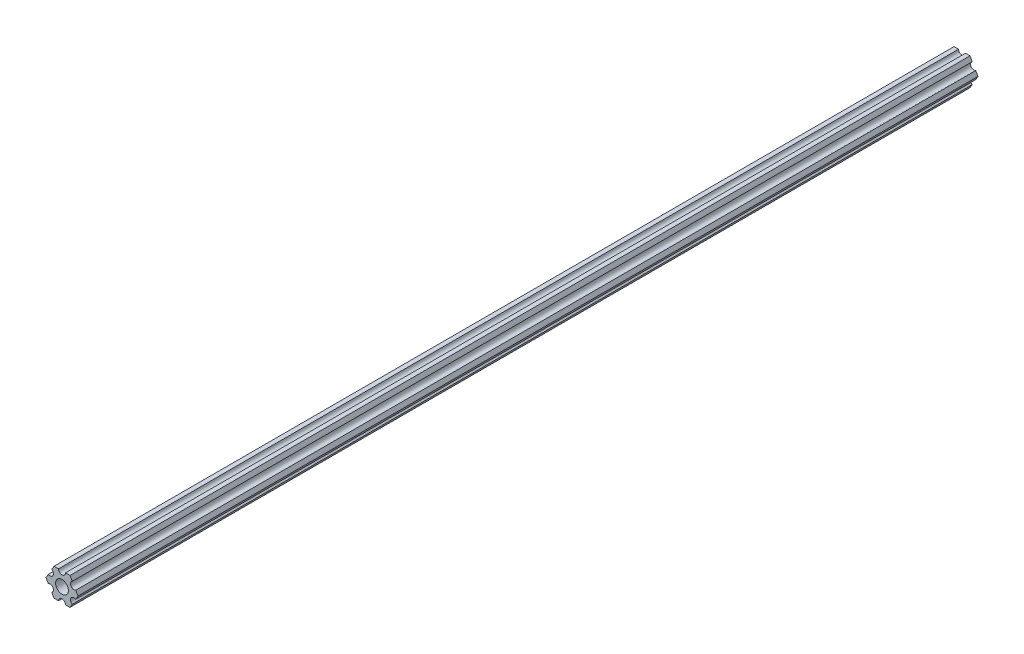
ISO-10303-21;
HEADER;
FILE_DESCRIPTION(('STEP AP214'),'2;1');
FILE_NAME('part.step','',(''),(''),'','','');
FILE_SCHEMA(('AUTOMOTIVE_DESIGN { 1 0 10303 214 1 1 1 1 }'));
ENDSEC;
DATA;
#1=APPLICATION_CONTEXT('core data for automotive mechanical design processes');
#2=APPLICATION_PROTOCOL_DEFINITION('international standard','automotive_design',2000,#1);
#3=PRODUCT_CONTEXT('',#1,'mechanical');
#4=PRODUCT('Part','Part','',(#3));
#5=PRODUCT_RELATED_PRODUCT_CATEGORY('part','',(#4));
#6=PRODUCT_DEFINITION_FORMATION('','',#4);
#7=PRODUCT_DEFINITION_CONTEXT('part definition',#1,'design');
#8=PRODUCT_DEFINITION('design','',#6,#7);
#9=PRODUCT_DEFINITION_SHAPE('','',#8);
#10=(LENGTH_UNIT() NAMED_UNIT(*) SI_UNIT(.MILLI.,.METRE.));
#11=(NAMED_UNIT(*) PLANE_ANGLE_UNIT() SI_UNIT($,.RADIAN.));
#12=(NAMED_UNIT(*) SI_UNIT($,.STERADIAN.) SOLID_ANGLE_UNIT());
#13=UNCERTAINTY_MEASURE_WITH_UNIT(LENGTH_MEASURE(1.E-05),#10,'distance_accuracy_value','');
#14=(GEOMETRIC_REPRESENTATION_CONTEXT(3) GLOBAL_UNCERTAINTY_ASSIGNED_CONTEXT((#13)) GLOBAL_UNIT_ASSIGNED_CONTEXT((#10,
#11,#12)) REPRESENTATION_CONTEXT('',''));
#15=CARTESIAN_POINT('',(0.,0.,0.));
#16=DIRECTION('',(0.,0.,1.));
#17=DIRECTION('',(1.,0.,0.));
#18=AXIS2_PLACEMENT_3D('',#15,#16,#17);
#19=CARTESIAN_POINT('',(6.29301142309098,-1.80018429024546,412.75));
#20=DIRECTION('',(-0.866025434075723,0.499999947533953,0.));
#21=DIRECTION('',(-0.499999947533953,-0.866025434075723,0.));
#22=AXIS2_PLACEMENT_3D('',#19,#20,#21);
#23=PLANE('',#22);
#24=DIRECTION('',(0.,0.,1.));
#25=VECTOR('',#24,1.);
#26=CARTESIAN_POINT('',(7.33234841870826,4.44212519169686E-07,412.75));
#27=LINE('',#26,#25);
#28=CARTESIAN_POINT('',(7.33234841870826,4.44212518961143E-07,0.));
#29=VERTEX_POINT('',#28);
#30=CARTESIAN_POINT('',(7.33234841870826,4.44212519315656E-07,412.75));
#31=VERTEX_POINT('',#30);
#32=EDGE_CURVE('E300',#29,#31,#27,.T.);
#33=ORIENTED_EDGE('',*,*,#32,.T.);
#34=DIRECTION('',(0.499999947533953,0.866025434075723,0.));
#35=VECTOR('',#34,1.);
#36=CARTESIAN_POINT('',(6.29301142309098,-1.80018429024546,412.75));
#37=LINE('',#36,#35);
#38=CARTESIAN_POINT('',(6.29301142309098,-1.80018429024546,412.75));
#39=VERTEX_POINT('',#38);
#40=EDGE_CURVE('E183',#39,#31,#37,.T.);
#41=ORIENTED_EDGE('',*,*,#40,.F.);
#42=DIRECTION('',(0.,0.,-1.));
#43=VECTOR('',#42,1.);
#44=CARTESIAN_POINT('',(6.29301142309098,-1.80018429024546,412.75));
#45=LINE('',#44,#43);
#46=CARTESIAN_POINT('',(6.29301142309098,-1.80018429024546,0.));
#47=VERTEX_POINT('',#46);
#48=EDGE_CURVE('E249',#39,#47,#45,.T.);
#49=ORIENTED_EDGE('',*,*,#48,.T.);
#50=DIRECTION('',(0.499999947533953,0.866025434075723,0.));
#51=VECTOR('',#50,1.);
#52=CARTESIAN_POINT('',(6.29301142309098,-1.80018429024546,0.));
#53=LINE('',#52,#51);
#54=EDGE_CURVE('E187',#47,#29,#53,.T.);
#55=ORIENTED_EDGE('',*,*,#54,.T.);
#56=EDGE_LOOP('',(#33,#41,#49,#55));
#57=FACE_BOUND('',#56,.T.);
#58=ADVANCED_FACE('F18',(#57),#23,.F.);
#59=CARTESIAN_POINT('',(7.33234841870826,4.44212519169686E-07,412.75));
#60=DIRECTION('',(-0.866025373493145,-0.500000052466056,0.));
#61=DIRECTION('',(0.500000052466056,-0.866025373493145,0.));
#62=AXIS2_PLACEMENT_3D('',#59,#60,#61);
#63=PLANE('',#62);
#64=DIRECTION('',(0.,0.,-1.));
#65=VECTOR('',#64,1.);
#66=CARTESIAN_POINT('',(6.29301120497139,1.80018505273895,412.75));
#67=LINE('',#66,#65);
#68=CARTESIAN_POINT('',(6.29301120497139,1.80018505273895,0.));
#69=VERTEX_POINT('',#68);
#70=CARTESIAN_POINT('',(6.29301120497139,1.80018505273895,412.75));
#71=VERTEX_POINT('',#70);
#72=EDGE_CURVE('E298',#69,#71,#67,.F.);
#73=ORIENTED_EDGE('',*,*,#72,.T.);
#74=DIRECTION('',(-0.500000052466056,0.866025373493145,0.));
#75=VECTOR('',#74,1.);
#76=CARTESIAN_POINT('',(7.33234841870826,4.44212519198905E-07,412.75));
#77=LINE('',#76,#75);
#78=EDGE_CURVE('E65',#31,#71,#77,.T.);
#79=ORIENTED_EDGE('',*,*,#78,.F.);
#80=ORIENTED_EDGE('',*,*,#32,.F.);
#81=DIRECTION('',(-0.500000052466056,0.866025373493145,0.));
#82=VECTOR('',#81,1.);
#83=CARTESIAN_POINT('',(7.33234841870826,4.44212519198905E-07,0.));
#84=LINE('',#83,#82);
#85=EDGE_CURVE('E246',#29,#69,#84,.T.);
#86=ORIENTED_EDGE('',*,*,#85,.T.);
#87=EDGE_LOOP('',(#73,#79,#80,#86));
#88=FACE_BOUND('',#87,.T.);
#89=ADVANCED_FACE('F347',(#88),#63,.F.);
#90=CARTESIAN_POINT('',(5.49926112168156,3.17500033315933,412.75));
#91=DIRECTION('',(0.,0.,-1.));
#92=DIRECTION('',(-1.,0.,0.));
#93=AXIS2_PLACEMENT_3D('',#90,#91,#92);
#94=CYLINDRICAL_SURFACE('',#93,1.5875);
#95=CARTESIAN_POINT('',(5.49926112168156,3.17500033315933,412.75));
#96=DIRECTION('',(0.,0.,-1.));
#97=DIRECTION('',(-1.,0.,0.));
#98=AXIS2_PLACEMENT_3D('',#95,#96,#97);
#99=CIRCLE('',#98,1.5875);
#100=CARTESIAN_POINT('',(4.70551103839172,4.54981561357972,412.75));
#101=VERTEX_POINT('',#100);
#102=EDGE_CURVE('E57',#71,#101,#99,.T.);
#103=ORIENTED_EDGE('',*,*,#102,.F.);
#104=ORIENTED_EDGE('',*,*,#72,.F.);
#105=CARTESIAN_POINT('',(5.49926112168156,3.17500033315933,0.));
#106=DIRECTION('',(0.,0.,-1.));
#107=DIRECTION('',(-1.,0.,0.));
#108=AXIS2_PLACEMENT_3D('',#105,#106,#107);
#109=CIRCLE('',#108,1.5875);
#110=CARTESIAN_POINT('',(4.70551103839172,4.54981561357972,0.));
#111=VERTEX_POINT('',#110);
#112=EDGE_CURVE('E21',#69,#111,#109,.T.);
#113=ORIENTED_EDGE('',*,*,#112,.T.);
#114=DIRECTION('',(0.,0.,1.));
#115=VECTOR('',#114,1.);
#116=CARTESIAN_POINT('',(4.70551103839172,4.54981561357972,412.75));
#117=LINE('',#116,#115);
#118=EDGE_CURVE('E294',#111,#101,#117,.T.);
#119=ORIENTED_EDGE('',*,*,#118,.T.);
#120=EDGE_LOOP('',(#103,#104,#113,#119));
#121=FACE_BOUND('',#120,.T.);
#122=ADVANCED_FACE('F345',(#121),#94,.F.);
#123=CARTESIAN_POINT('',(4.70551103839172,4.54981561357972,412.75));
#124=DIRECTION('',(-0.866025373493151,-0.500000052466046,0.));
#125=DIRECTION('',(0.500000052466046,-0.866025373493151,0.));
#126=AXIS2_PLACEMENT_3D('',#123,#124,#125);
#127=PLANE('',#126);
#128=DIRECTION('',(0.,0.,1.));
#129=VECTOR('',#128,1.);
#130=CARTESIAN_POINT('',(3.66617382465481,6.35000022210627,412.75));
#131=LINE('',#130,#129);
#132=CARTESIAN_POINT('',(3.66617382465481,6.35000022210627,-1.29526019539602E-13));
#133=VERTEX_POINT('',#132);
#134=CARTESIAN_POINT('',(3.66617382465481,6.35000022210627,412.75));
#135=VERTEX_POINT('',#134);
#136=EDGE_CURVE('E291',#133,#135,#131,.T.);
#137=ORIENTED_EDGE('',*,*,#136,.T.);
#138=DIRECTION('',(-0.500000052466046,0.866025373493151,0.));
#139=VECTOR('',#138,1.);
#140=CARTESIAN_POINT('',(4.70551103839172,4.54981561357972,412.75));
#141=LINE('',#140,#139);
#142=EDGE_CURVE('E176',#101,#135,#141,.T.);
#143=ORIENTED_EDGE('',*,*,#142,.F.);
#144=ORIENTED_EDGE('',*,*,#118,.F.);
#145=DIRECTION('',(-0.500000052466046,0.866025373493151,0.));
#146=VECTOR('',#145,1.);
#147=CARTESIAN_POINT('',(4.70551103839172,4.54981561357972,0.));
#148=LINE('',#147,#146);
#149=EDGE_CURVE('E239',#111,#133,#148,.T.);
#150=ORIENTED_EDGE('',*,*,#149,.T.);
#151=EDGE_LOOP('',(#137,#143,#144,#150));
#152=FACE_BOUND('',#151,.T.);
#153=ADVANCED_FACE('F338',(#152),#127,.F.);
#154=CARTESIAN_POINT('',(3.66617382465481,6.35000022210627,412.75));
#155=DIRECTION('',(6.05825850611185E-08,-0.999999999999998,0.));
#156=DIRECTION('',(0.999999999999998,6.05825850611185E-08,0.));
#157=AXIS2_PLACEMENT_3D('',#154,#155,#156);
#158=PLANE('',#157);
#159=DIRECTION('',(0.,0.,-1.));
#160=VECTOR('',#159,1.);
#161=CARTESIAN_POINT('',(1.58749961530074,6.35000009617482,412.75));
#162=LINE('',#161,#160);
#163=CARTESIAN_POINT('',(1.58749961530073,6.35000015914054,0.));
#164=VERTEX_POINT('',#163);
#165=CARTESIAN_POINT('',(1.58749961530073,6.35000015914054,412.75));
#166=VERTEX_POINT('',#165);
#167=EDGE_CURVE('E289',#164,#166,#162,.F.);
#168=ORIENTED_EDGE('',*,*,#167,.T.);
#169=DIRECTION('',(1.,0.,0.));
#170=VECTOR('',#169,1.);
#171=CARTESIAN_POINT('',(5.49926112168156,6.35000022210627,412.75));
#172=LINE('',#171,#170);
#173=EDGE_CURVE('E146',#135,#166,#172,.F.);
#174=ORIENTED_EDGE('',*,*,#173,.F.);
#175=ORIENTED_EDGE('',*,*,#136,.F.);
#176=DIRECTION('',(1.,0.,0.));
#177=VECTOR('',#176,1.);
#178=CARTESIAN_POINT('',(5.49926112168156,6.35000022210627,0.));
#179=LINE('',#178,#177);
#180=EDGE_CURVE('E236',#133,#164,#179,.F.);
#181=ORIENTED_EDGE('',*,*,#180,.T.);
#182=EDGE_LOOP('',(#168,#174,#175,#181));
#183=FACE_BOUND('',#182,.T.);
#184=ADVANCED_FACE('F335',(#183),#158,.F.);
#185=CARTESIAN_POINT('',(-3.84699260060323E-07,6.35,412.75));
#186=DIRECTION('',(0.,0.,-1.));
#187=DIRECTION('',(-1.,0.,0.));
#188=AXIS2_PLACEMENT_3D('',#185,#186,#187);
#189=CYLINDRICAL_SURFACE('',#188,1.5875);
#190=DIRECTION('',(0.,0.,1.));
#191=VECTOR('',#190,1.);
#192=CARTESIAN_POINT('',(-1.58750038469926,6.34999990382518,412.75));
#193=LINE('',#192,#191);
#194=CARTESIAN_POINT('',(-1.58750038469926,6.34999990382518,0.));
#195=VERTEX_POINT('',#194);
#196=CARTESIAN_POINT('',(-1.58750038469926,6.34999990382518,412.75));
#197=VERTEX_POINT('',#196);
#198=EDGE_CURVE('E105',#195,#197,#193,.T.);
#199=ORIENTED_EDGE('',*,*,#198,.T.);
#200=CARTESIAN_POINT('',(-3.84699260060323E-07,6.35,412.75));
#201=DIRECTION('',(0.,0.,-1.));
#202=DIRECTION('',(-1.,0.,0.));
#203=AXIS2_PLACEMENT_3D('',#200,#201,#202);
#204=CIRCLE('',#203,1.5875);
#205=EDGE_CURVE('E150',#166,#197,#204,.T.);
#206=ORIENTED_EDGE('',*,*,#205,.F.);
#207=ORIENTED_EDGE('',*,*,#167,.F.);
#208=CARTESIAN_POINT('',(-3.84699260060323E-07,6.35,0.));
#209=DIRECTION('',(0.,0.,-1.));
#210=DIRECTION('',(-1.,0.,0.));
#211=AXIS2_PLACEMENT_3D('',#208,#209,#210);
#212=CIRCLE('',#211,1.5875);
#213=EDGE_CURVE('E233',#164,#195,#212,.T.);
#214=ORIENTED_EDGE('',*,*,#213,.T.);
#215=EDGE_LOOP('',(#199,#206,#207,#214));
#216=FACE_BOUND('',#215,.T.);
#217=ADVANCED_FACE('F329',(#216),#189,.F.);
#218=CARTESIAN_POINT('',(-1.58750038469926,6.34999990382518,412.75));
#219=DIRECTION('',(6.05825963273174E-08,-0.999999999999998,0.));
#220=DIRECTION('',(0.999999999999998,6.05825963273174E-08,0.));
#221=AXIS2_PLACEMENT_3D('',#218,#219,#220);
#222=PLANE('',#221);
#223=DIRECTION('',(0.,0.,1.));
#224=VECTOR('',#223,1.);
#225=CARTESIAN_POINT('',(-3.66617459405349,6.3499997778937,412.75));
#226=LINE('',#225,#224);
#227=CARTESIAN_POINT('',(-3.66617454558244,6.34999986184803,-1.29526019539602E-13));
#228=VERTEX_POINT('',#227);
#229=CARTESIAN_POINT('',(-3.66617454558244,6.34999986184803,412.75));
#230=VERTEX_POINT('',#229);
#231=EDGE_CURVE('E113',#228,#230,#226,.T.);
#232=ORIENTED_EDGE('',*,*,#231,.T.);
#233=DIRECTION('',(1.,0.,0.));
#234=VECTOR('',#233,1.);
#235=CARTESIAN_POINT('',(5.49926112168156,6.34999990382518,412.75));
#236=LINE('',#235,#234);
#237=EDGE_CURVE('E151',#197,#230,#236,.F.);
#238=ORIENTED_EDGE('',*,*,#237,.F.);
#239=ORIENTED_EDGE('',*,*,#198,.F.);
#240=DIRECTION('',(1.,0.,0.));
#241=VECTOR('',#240,1.);
#242=CARTESIAN_POINT('',(5.49926112168156,6.34999990382518,0.));
#243=LINE('',#242,#241);
#244=EDGE_CURVE('E158',#195,#228,#243,.F.);
#245=ORIENTED_EDGE('',*,*,#244,.T.);
#246=EDGE_LOOP('',(#232,#238,#239,#245));
#247=FACE_BOUND('',#246,.T.);
#248=ADVANCED_FACE('F157',(#247),#222,.F.);
#249=CARTESIAN_POINT('',(-3.66617459405349,6.3499997778937,412.75));
#250=DIRECTION('',(0.866025434075729,-0.499999947533942,0.));
#251=DIRECTION('',(0.499999947533942,0.866025434075729,0.));
#252=AXIS2_PLACEMENT_3D('',#249,#250,#251);
#253=PLANE('',#252);
#254=DIRECTION('',(0.,0.,-1.));
#255=VECTOR('',#254,1.);
#256=CARTESIAN_POINT('',(-4.70551158967065,4.54981504343587,412.75));
#257=LINE('',#256,#255);
#258=CARTESIAN_POINT('',(-4.70551158967065,4.54981504343587,0.));
#259=VERTEX_POINT('',#258);
#260=CARTESIAN_POINT('',(-4.70551158967065,4.54981504343587,412.75));
#261=VERTEX_POINT('',#260);
#262=EDGE_CURVE('E159',#259,#261,#257,.F.);
#263=ORIENTED_EDGE('',*,*,#262,.T.);
#264=DIRECTION('',(-0.499999947533943,-0.866025434075729,0.));
#265=VECTOR('',#264,1.);
#266=CARTESIAN_POINT('',(-3.66617459405349,6.3499997778937,412.75));
#267=LINE('',#266,#265);
#268=EDGE_CURVE('E154',#230,#261,#267,.T.);
#269=ORIENTED_EDGE('',*,*,#268,.F.);
#270=ORIENTED_EDGE('',*,*,#231,.F.);
#271=DIRECTION('',(-0.499999947533943,-0.866025434075729,0.));
#272=VECTOR('',#271,1.);
#273=CARTESIAN_POINT('',(-3.66617459405349,6.3499997778937,0.));
#274=LINE('',#273,#272);
#275=EDGE_CURVE('E228',#228,#259,#274,.T.);
#276=ORIENTED_EDGE('',*,*,#275,.T.);
#277=EDGE_LOOP('',(#263,#269,#270,#276));
#278=FACE_BOUND('',#277,.T.);
#279=ADVANCED_FACE('F161',(#278),#253,.F.);
#280=CARTESIAN_POINT('',(-5.49926150638082,3.17499966684067,412.75));
#281=DIRECTION('',(0.,0.,-1.));
#282=DIRECTION('',(-1.,0.,0.));
#283=AXIS2_PLACEMENT_3D('',#280,#281,#282);
#284=CYLINDRICAL_SURFACE('',#283,1.5875);
#285=DIRECTION('',(0.,0.,1.));
#286=VECTOR('',#285,1.);
#287=CARTESIAN_POINT('',(-6.29301142309098,1.80018429024547,412.75));
#288=LINE('',#287,#286);
#289=CARTESIAN_POINT('',(-6.29301142309098,1.80018429024547,0.));
#290=VERTEX_POINT('',#289);
#291=CARTESIAN_POINT('',(-6.29301142309098,1.80018429024547,412.75));
#292=VERTEX_POINT('',#291);
#293=EDGE_CURVE('E280',#290,#292,#288,.T.);
#294=ORIENTED_EDGE('',*,*,#293,.T.);
#295=CARTESIAN_POINT('',(-5.49926150638082,3.17499966684067,412.75));
#296=DIRECTION('',(0.,0.,-1.));
#297=DIRECTION('',(-1.,0.,0.));
#298=AXIS2_PLACEMENT_3D('',#295,#296,#297);
#299=CIRCLE('',#298,1.5875);
#300=EDGE_CURVE('E163',#261,#292,#299,.T.);
#301=ORIENTED_EDGE('',*,*,#300,.F.);
#302=ORIENTED_EDGE('',*,*,#262,.F.);
#303=CARTESIAN_POINT('',(-5.49926150638082,3.17499966684067,0.));
#304=DIRECTION('',(0.,0.,-1.));
#305=DIRECTION('',(-1.,0.,0.));
#306=AXIS2_PLACEMENT_3D('',#303,#304,#305);
#307=CIRCLE('',#306,1.5875);
#308=EDGE_CURVE('E225',#259,#290,#307,.T.);
#309=ORIENTED_EDGE('',*,*,#308,.T.);
#310=EDGE_LOOP('',(#294,#301,#302,#309));
#311=FACE_BOUND('',#310,.T.);
#312=ADVANCED_FACE('F410',(#311),#284,.F.);
#313=CARTESIAN_POINT('',(-6.29301142309098,1.80018429024547,412.75));
#314=DIRECTION('',(0.866025434075724,-0.499999947533951,0.));
#315=DIRECTION('',(0.499999947533951,0.866025434075724,0.));
#316=AXIS2_PLACEMENT_3D('',#313,#314,#315);
#317=PLANE('',#316);
#318=DIRECTION('',(0.,0.,1.));
#319=VECTOR('',#318,1.);
#320=CARTESIAN_POINT('',(-7.33234841870826,-4.44212523790841E-07,412.75));
#321=LINE('',#320,#319);
#322=CARTESIAN_POINT('',(-7.33234841870826,-4.44212524036367E-07,0.));
#323=VERTEX_POINT('',#322);
#324=CARTESIAN_POINT('',(-7.33234841870826,-4.44212524036367E-07,412.75));
#325=VERTEX_POINT('',#324);
#326=EDGE_CURVE('E277',#323,#325,#321,.T.);
#327=ORIENTED_EDGE('',*,*,#326,.T.);
#328=DIRECTION('',(-0.499999947533952,-0.866025434075724,0.));
#329=VECTOR('',#328,1.);
#330=CARTESIAN_POINT('',(-6.29301142309098,1.80018429024547,412.75));
#331=LINE('',#330,#329);
#332=EDGE_CURVE('E165',#292,#325,#331,.T.);
#333=ORIENTED_EDGE('',*,*,#332,.F.);
#334=ORIENTED_EDGE('',*,*,#293,.F.);
#335=DIRECTION('',(-0.499999947533952,-0.866025434075724,0.));
#336=VECTOR('',#335,1.);
#337=CARTESIAN_POINT('',(-6.29301142309098,1.80018429024547,0.));
#338=LINE('',#337,#336);
#339=EDGE_CURVE('E220',#290,#323,#338,.T.);
#340=ORIENTED_EDGE('',*,*,#339,.T.);
#341=EDGE_LOOP('',(#327,#333,#334,#340));
#342=FACE_BOUND('',#341,.T.);
#343=ADVANCED_FACE('F378',(#342),#317,.F.);
#344=CARTESIAN_POINT('',(-7.33234841870826,-4.44212523790841E-07,412.75));
#345=DIRECTION('',(0.866025373493151,0.500000052466045,0.));
#346=DIRECTION('',(-0.500000052466045,0.866025373493151,0.));
#347=AXIS2_PLACEMENT_3D('',#344,#345,#346);
#348=PLANE('',#347);
#349=DIRECTION('',(0.,0.,-1.));
#350=VECTOR('',#349,1.);
#351=CARTESIAN_POINT('',(-6.29301120497141,-1.80018505273896,412.75));
#352=LINE('',#351,#350);
#353=CARTESIAN_POINT('',(-6.29301120497141,-1.80018505273896,0.));
#354=VERTEX_POINT('',#353);
#355=CARTESIAN_POINT('',(-6.29301120497141,-1.80018505273896,412.75));
#356=VERTEX_POINT('',#355);
#357=EDGE_CURVE('E274',#354,#356,#352,.F.);
#358=ORIENTED_EDGE('',*,*,#357,.T.);
#359=DIRECTION('',(0.500000052466045,-0.866025373493151,0.));
#360=VECTOR('',#359,1.);
#361=CARTESIAN_POINT('',(-7.33234841870826,-4.44212523969395E-07,412.75));
#362=LINE('',#361,#360);
#363=EDGE_CURVE('E315',#325,#356,#362,.T.);
#364=ORIENTED_EDGE('',*,*,#363,.F.);
#365=ORIENTED_EDGE('',*,*,#326,.F.);
#366=DIRECTION('',(0.500000052466045,-0.866025373493151,0.));
#367=VECTOR('',#366,1.);
#368=CARTESIAN_POINT('',(-7.33234841870826,-4.44212523969395E-07,0.));
#369=LINE('',#368,#367);
#370=EDGE_CURVE('E217',#323,#354,#369,.T.);
#371=ORIENTED_EDGE('',*,*,#370,.T.);
#372=EDGE_LOOP('',(#358,#364,#365,#371));
#373=FACE_BOUND('',#372,.T.);
#374=ADVANCED_FACE('F382',(#373),#348,.F.);
#375=CARTESIAN_POINT('',(-5.49926112168156,-3.17500033315934,412.75));
#376=DIRECTION('',(0.,0.,-1.));
#377=DIRECTION('',(-1.,0.,0.));
#378=AXIS2_PLACEMENT_3D('',#375,#376,#377);
#379=CYLINDRICAL_SURFACE('',#378,1.5875);
#380=DIRECTION('',(0.,0.,1.));
#381=VECTOR('',#380,1.);
#382=CARTESIAN_POINT('',(-4.70551103839172,-4.54981561357972,412.75));
#383=LINE('',#382,#381);
#384=CARTESIAN_POINT('',(-4.70551103839172,-4.54981561357972,0.));
#385=VERTEX_POINT('',#384);
#386=CARTESIAN_POINT('',(-4.70551103839172,-4.54981561357972,412.75));
#387=VERTEX_POINT('',#386);
#388=EDGE_CURVE('E269',#385,#387,#383,.T.);
#389=ORIENTED_EDGE('',*,*,#388,.T.);
#390=CARTESIAN_POINT('',(-5.49926112168156,-3.17500033315934,412.75));
#391=DIRECTION('',(0.,0.,-1.));
#392=DIRECTION('',(-1.,0.,0.));
#393=AXIS2_PLACEMENT_3D('',#390,#391,#392);
#394=CIRCLE('',#393,1.5875);
#395=EDGE_CURVE('E313',#356,#387,#394,.T.);
#396=ORIENTED_EDGE('',*,*,#395,.F.);
#397=ORIENTED_EDGE('',*,*,#357,.F.);
#398=CARTESIAN_POINT('',(-5.49926112168156,-3.17500033315934,0.));
#399=DIRECTION('',(0.,0.,-1.));
#400=DIRECTION('',(-1.,0.,0.));
#401=AXIS2_PLACEMENT_3D('',#398,#399,#400);
#402=CIRCLE('',#401,1.5875);
#403=EDGE_CURVE('E214',#354,#385,#402,.T.);
#404=ORIENTED_EDGE('',*,*,#403,.T.);
#405=EDGE_LOOP('',(#389,#396,#397,#404));
#406=FACE_BOUND('',#405,.T.);
#407=ADVANCED_FACE('F386',(#406),#379,.F.);
#408=CARTESIAN_POINT('',(-4.70551103839172,-4.54981561357972,412.75));
#409=DIRECTION('',(0.866025373493151,0.500000052466045,0.));
#410=DIRECTION('',(-0.500000052466045,0.866025373493151,0.));
#411=AXIS2_PLACEMENT_3D('',#408,#409,#410);
#412=PLANE('',#411);
#413=DIRECTION('',(0.,0.,1.));
#414=VECTOR('',#413,1.);
#415=CARTESIAN_POINT('',(-3.66617382465481,-6.35000022210628,412.75));
#416=LINE('',#415,#414);
#417=CARTESIAN_POINT('',(-3.6661738246548,-6.35000022210628,-1.29526019539602E-13));
#418=VERTEX_POINT('',#417);
#419=CARTESIAN_POINT('',(-3.6661738246548,-6.35000022210628,412.75));
#420=VERTEX_POINT('',#419);
#421=EDGE_CURVE('E266',#418,#420,#416,.T.);
#422=ORIENTED_EDGE('',*,*,#421,.T.);
#423=DIRECTION('',(0.500000052466045,-0.866025373493151,0.));
#424=VECTOR('',#423,1.);
#425=CARTESIAN_POINT('',(-4.70551103839172,-4.54981561357972,412.75));
#426=LINE('',#425,#424);
#427=EDGE_CURVE('E314',#387,#420,#426,.T.);
#428=ORIENTED_EDGE('',*,*,#427,.F.);
#429=ORIENTED_EDGE('',*,*,#388,.F.);
#430=DIRECTION('',(0.500000052466045,-0.866025373493151,0.));
#431=VECTOR('',#430,1.);
#432=CARTESIAN_POINT('',(-4.70551103839172,-4.54981561357972,0.));
#433=LINE('',#432,#431);
#434=EDGE_CURVE('E209',#385,#418,#433,.T.);
#435=ORIENTED_EDGE('',*,*,#434,.T.);
#436=EDGE_LOOP('',(#422,#428,#429,#435));
#437=FACE_BOUND('',#436,.T.);
#438=ADVANCED_FACE('F392',(#437),#412,.F.);
#439=CARTESIAN_POINT('',(-3.66617382465481,-6.35000022210628,412.75));
#440=DIRECTION('',(-6.05825854783851E-08,0.999999999999998,0.));
#441=DIRECTION('',(-0.999999999999998,-6.05825854783851E-08,0.));
#442=AXIS2_PLACEMENT_3D('',#439,#440,#441);
#443=PLANE('',#442);
#444=DIRECTION('',(0.,0.,-1.));
#445=VECTOR('',#444,1.);
#446=CARTESIAN_POINT('',(-1.58749961530074,-6.35,412.75));
#447=LINE('',#446,#445);
#448=CARTESIAN_POINT('',(-1.58749961530073,-6.35000011105314,0.));
#449=VERTEX_POINT('',#448);
#450=CARTESIAN_POINT('',(-1.58749961530073,-6.35000011105314,412.75));
#451=VERTEX_POINT('',#450);
#452=EDGE_CURVE('E263',#449,#451,#447,.F.);
#453=ORIENTED_EDGE('',*,*,#452,.T.);
#454=DIRECTION('',(1.,0.,0.));
#455=VECTOR('',#454,1.);
#456=CARTESIAN_POINT('',(5.49926112168156,-6.35000022210628,412.75));
#457=LINE('',#456,#455);
#458=EDGE_CURVE('E312',#420,#451,#457,.T.);
#459=ORIENTED_EDGE('',*,*,#458,.F.);
#460=ORIENTED_EDGE('',*,*,#421,.F.);
#461=DIRECTION('',(1.,0.,0.));
#462=VECTOR('',#461,1.);
#463=CARTESIAN_POINT('',(5.49926112168156,-6.35000022210628,0.));
#464=LINE('',#463,#462);
#465=EDGE_CURVE('E206',#418,#449,#464,.T.);
#466=ORIENTED_EDGE('',*,*,#465,.T.);
#467=EDGE_LOOP('',(#453,#459,#460,#466));
#468=FACE_BOUND('',#467,.T.);
#469=ADVANCED_FACE('F396',(#468),#443,.F.);
#470=CARTESIAN_POINT('',(3.8469926204343E-07,-6.35,412.75));
#471=DIRECTION('',(0.,0.,-1.));
#472=DIRECTION('',(-1.,0.,0.));
#473=AXIS2_PLACEMENT_3D('',#470,#471,#472);
#474=CYLINDRICAL_SURFACE('',#473,1.5875);
#475=DIRECTION('',(0.,0.,1.));
#476=VECTOR('',#475,1.);
#477=CARTESIAN_POINT('',(1.58750038469926,-6.34999990382518,412.75));
#478=LINE('',#477,#476);
#479=CARTESIAN_POINT('',(1.58750038469926,-6.34999990382518,0.));
#480=VERTEX_POINT('',#479);
#481=CARTESIAN_POINT('',(1.58750038469926,-6.34999990382518,412.75));
#482=VERTEX_POINT('',#481);
#483=EDGE_CURVE('E258',#480,#482,#478,.T.);
#484=ORIENTED_EDGE('',*,*,#483,.T.);
#485=CARTESIAN_POINT('',(3.8469926204343E-07,-6.35,412.75));
#486=DIRECTION('',(0.,0.,-1.));
#487=DIRECTION('',(-1.,0.,0.));
#488=AXIS2_PLACEMENT_3D('',#485,#486,#487);
#489=CIRCLE('',#488,1.5875);
#490=EDGE_CURVE('E309',#451,#482,#489,.T.);
#491=ORIENTED_EDGE('',*,*,#490,.F.);
#492=ORIENTED_EDGE('',*,*,#452,.F.);
#493=CARTESIAN_POINT('',(3.8469926204343E-07,-6.35,0.));
#494=DIRECTION('',(0.,0.,-1.));
#495=DIRECTION('',(-1.,0.,0.));
#496=AXIS2_PLACEMENT_3D('',#493,#494,#495);
#497=CIRCLE('',#496,1.5875);
#498=EDGE_CURVE('E203',#449,#480,#497,.T.);
#499=ORIENTED_EDGE('',*,*,#498,.T.);
#500=EDGE_LOOP('',(#484,#491,#492,#499));
#501=FACE_BOUND('',#500,.T.);
#502=ADVANCED_FACE('F400',(#501),#474,.F.);
#503=CARTESIAN_POINT('',(1.58750038469926,-6.34999990382518,412.75));
#504=DIRECTION('',(-6.05825721258438E-08,0.999999999999998,0.));
#505=DIRECTION('',(-0.999999999999998,-6.05825721258438E-08,0.));
#506=AXIS2_PLACEMENT_3D('',#503,#504,#505);
#507=PLANE('',#506);
#508=DIRECTION('',(0.,0.,1.));
#509=VECTOR('',#508,1.);
#510=CARTESIAN_POINT('',(3.66617459405346,-6.34999977789375,412.75));
#511=LINE('',#510,#509);
#512=CARTESIAN_POINT('',(3.66617454558244,-6.34999986184804,-1.29526019539602E-13));
#513=VERTEX_POINT('',#512);
#514=CARTESIAN_POINT('',(3.66617454558244,-6.34999986184804,412.75));
#515=VERTEX_POINT('',#514);
#516=EDGE_CURVE('E255',#513,#515,#511,.T.);
#517=ORIENTED_EDGE('',*,*,#516,.T.);
#518=DIRECTION('',(1.,0.,0.));
#519=VECTOR('',#518,1.);
#520=CARTESIAN_POINT('',(5.49926112168156,-6.34999990382518,412.75));
#521=LINE('',#520,#519);
#522=EDGE_CURVE('E311',#482,#515,#521,.T.);
#523=ORIENTED_EDGE('',*,*,#522,.F.);
#524=ORIENTED_EDGE('',*,*,#483,.F.);
#525=DIRECTION('',(1.,0.,0.));
#526=VECTOR('',#525,1.);
#527=CARTESIAN_POINT('',(5.49926112168156,-6.34999990382518,0.));
#528=LINE('',#527,#526);
#529=EDGE_CURVE('E198',#480,#513,#528,.T.);
#530=ORIENTED_EDGE('',*,*,#529,.T.);
#531=EDGE_LOOP('',(#517,#523,#524,#530));
#532=FACE_BOUND('',#531,.T.);
#533=ADVANCED_FACE('F403',(#532),#507,.F.);
#534=CARTESIAN_POINT('',(3.66617459405346,-6.34999977789375,412.75));
#535=DIRECTION('',(-0.86602543407573,0.499999947533941,0.));
#536=DIRECTION('',(-0.499999947533941,-0.86602543407573,0.));
#537=AXIS2_PLACEMENT_3D('',#534,#535,#536);
#538=PLANE('',#537);
#539=DIRECTION('',(0.,0.,1.));
#540=VECTOR('',#539,1.);
#541=CARTESIAN_POINT('',(4.70551158967065,-4.54981504343587,412.75));
#542=LINE('',#541,#540);
#543=CARTESIAN_POINT('',(4.70551158967065,-4.54981504343587,412.75));
#544=VERTEX_POINT('',#543);
#545=CARTESIAN_POINT('',(4.70551158967065,-4.54981504343587,0.));
#546=VERTEX_POINT('',#545);
#547=EDGE_CURVE('E253',#544,#546,#542,.F.);
#548=ORIENTED_EDGE('',*,*,#547,.F.);
#549=DIRECTION('',(0.49999994753394,0.86602543407573,0.));
#550=VECTOR('',#549,1.);
#551=CARTESIAN_POINT('',(3.66617459405346,-6.34999977789376,412.75));
#552=LINE('',#551,#550);
#553=EDGE_CURVE('E308',#515,#544,#552,.T.);
#554=ORIENTED_EDGE('',*,*,#553,.F.);
#555=ORIENTED_EDGE('',*,*,#516,.F.);
#556=DIRECTION('',(0.49999994753394,0.86602543407573,0.));
#557=VECTOR('',#556,1.);
#558=CARTESIAN_POINT('',(3.66617459405346,-6.34999977789376,0.));
#559=LINE('',#558,#557);
#560=EDGE_CURVE('E195',#513,#546,#559,.T.);
#561=ORIENTED_EDGE('',*,*,#560,.T.);
#562=EDGE_LOOP('',(#548,#554,#555,#561));
#563=FACE_BOUND('',#562,.T.);
#564=ADVANCED_FACE('F405',(#563),#538,.F.);
#565=CARTESIAN_POINT('',(5.49926150638082,-3.17499966684067,412.75));
#566=DIRECTION('',(0.,0.,-1.));
#567=DIRECTION('',(-1.,0.,0.));
#568=AXIS2_PLACEMENT_3D('',#565,#566,#567);
#569=CYLINDRICAL_SURFACE('',#568,1.58750000000001);
#570=CARTESIAN_POINT('',(5.49926150638082,-3.17499966684067,412.75));
#571=DIRECTION('',(0.,0.,-1.));
#572=DIRECTION('',(-1.,0.,0.));
#573=AXIS2_PLACEMENT_3D('',#570,#571,#572);
#574=CIRCLE('',#573,1.58750000000001);
#575=EDGE_CURVE('E36',#544,#39,#574,.T.);
#576=ORIENTED_EDGE('',*,*,#575,.F.);
#577=ORIENTED_EDGE('',*,*,#547,.T.);
#578=CARTESIAN_POINT('',(5.49926150638082,-3.17499966684067,0.));
#579=DIRECTION('',(0.,0.,-1.));
#580=DIRECTION('',(-1.,0.,0.));
#581=AXIS2_PLACEMENT_3D('',#578,#579,#580);
#582=CIRCLE('',#581,1.58750000000001);
#583=EDGE_CURVE('E192',#546,#47,#582,.T.);
#584=ORIENTED_EDGE('',*,*,#583,.T.);
#585=ORIENTED_EDGE('',*,*,#48,.F.);
#586=EDGE_LOOP('',(#576,#577,#584,#585));
#587=FACE_BOUND('',#586,.T.);
#588=ADVANCED_FACE('F351',(#587),#569,.F.);
#589=CARTESIAN_POINT('',(5.49926112168156,3.17500033315933,0.));
#590=DIRECTION('',(0.,0.,1.));
#591=DIRECTION('',(1.,0.,0.));
#592=AXIS2_PLACEMENT_3D('',#589,#590,#591);
#593=PLANE('',#592);
#594=CARTESIAN_POINT('',(0.,0.,0.));
#595=DIRECTION('',(0.,0.,-1.));
#596=DIRECTION('',(-1.,0.,0.));
#597=AXIS2_PLACEMENT_3D('',#594,#595,#596);
#598=CIRCLE('',#597,2.9337);
#599=CARTESIAN_POINT('',(-2.9337,0.,0.));
#600=VERTEX_POINT('',#599);
#601=EDGE_CURVE('E27',#600,#600,#598,.F.);
#602=ORIENTED_EDGE('',*,*,#601,.T.);
#603=EDGE_LOOP('',(#602));
#604=FACE_BOUND('',#603,.T.);
#605=ORIENTED_EDGE('',*,*,#583,.F.);
#606=ORIENTED_EDGE('',*,*,#560,.F.);
#607=ORIENTED_EDGE('',*,*,#529,.F.);
#608=ORIENTED_EDGE('',*,*,#498,.F.);
#609=ORIENTED_EDGE('',*,*,#465,.F.);
#610=ORIENTED_EDGE('',*,*,#434,.F.);
#611=ORIENTED_EDGE('',*,*,#403,.F.);
#612=ORIENTED_EDGE('',*,*,#370,.F.);
#613=ORIENTED_EDGE('',*,*,#339,.F.);
#614=ORIENTED_EDGE('',*,*,#308,.F.);
#615=ORIENTED_EDGE('',*,*,#275,.F.);
#616=ORIENTED_EDGE('',*,*,#244,.F.);
#617=ORIENTED_EDGE('',*,*,#213,.F.);
#618=ORIENTED_EDGE('',*,*,#180,.F.);
#619=ORIENTED_EDGE('',*,*,#149,.F.);
#620=ORIENTED_EDGE('',*,*,#112,.F.);
#621=ORIENTED_EDGE('',*,*,#85,.F.);
#622=ORIENTED_EDGE('',*,*,#54,.F.);
#623=EDGE_LOOP('',(#605,#606,#607,#608,#609,#610,#611,#612,#613,#614,#615,#616,#617,#618,#619,
#620,#621,#622));
#624=FACE_BOUND('',#623,.T.);
#625=ADVANCED_FACE('F332',(#604,#624),#593,.F.);
#626=CARTESIAN_POINT('',(5.49926112168156,3.17500033315933,412.75));
#627=DIRECTION('',(0.,0.,1.));
#628=DIRECTION('',(1.,0.,0.));
#629=AXIS2_PLACEMENT_3D('',#626,#627,#628);
#630=PLANE('',#629);
#631=CARTESIAN_POINT('',(0.,0.,412.75));
#632=DIRECTION('',(0.,0.,-1.));
#633=DIRECTION('',(-1.,0.,0.));
#634=AXIS2_PLACEMENT_3D('',#631,#632,#633);
#635=CIRCLE('',#634,2.9337);
#636=CARTESIAN_POINT('',(-2.9337,0.,412.75));
#637=VERTEX_POINT('',#636);
#638=EDGE_CURVE('E11',#637,#637,#635,.T.);
#639=ORIENTED_EDGE('',*,*,#638,.T.);
#640=EDGE_LOOP('',(#639));
#641=FACE_BOUND('',#640,.T.);
#642=ORIENTED_EDGE('',*,*,#553,.T.);
#643=ORIENTED_EDGE('',*,*,#575,.T.);
#644=ORIENTED_EDGE('',*,*,#40,.T.);
#645=ORIENTED_EDGE('',*,*,#78,.T.);
#646=ORIENTED_EDGE('',*,*,#102,.T.);
#647=ORIENTED_EDGE('',*,*,#142,.T.);
#648=ORIENTED_EDGE('',*,*,#173,.T.);
#649=ORIENTED_EDGE('',*,*,#205,.T.);
#650=ORIENTED_EDGE('',*,*,#237,.T.);
#651=ORIENTED_EDGE('',*,*,#268,.T.);
#652=ORIENTED_EDGE('',*,*,#300,.T.);
#653=ORIENTED_EDGE('',*,*,#332,.T.);
#654=ORIENTED_EDGE('',*,*,#363,.T.);
#655=ORIENTED_EDGE('',*,*,#395,.T.);
#656=ORIENTED_EDGE('',*,*,#427,.T.);
#657=ORIENTED_EDGE('',*,*,#458,.T.);
#658=ORIENTED_EDGE('',*,*,#490,.T.);
#659=ORIENTED_EDGE('',*,*,#522,.T.);
#660=EDGE_LOOP('',(#642,#643,#644,#645,#646,#647,#648,#649,#650,#651,#652,#653,#654,#655,#656,
#657,#658,#659));
#661=FACE_BOUND('',#660,.T.);
#662=ADVANCED_FACE('F153',(#641,#661),#630,.T.);
#663=CARTESIAN_POINT('',(0.,0.,412.75));
#664=DIRECTION('',(0.,0.,-1.));
#665=DIRECTION('',(-1.,0.,0.));
#666=AXIS2_PLACEMENT_3D('',#663,#664,#665);
#667=CYLINDRICAL_SURFACE('',#666,2.9337);
#668=ORIENTED_EDGE('',*,*,#601,.F.);
#669=EDGE_LOOP('',(#668));
#670=FACE_BOUND('',#669,.T.);
#671=ORIENTED_EDGE('',*,*,#638,.F.);
#672=EDGE_LOOP('',(#671));
#673=FACE_BOUND('',#672,.T.);
#674=ADVANCED_FACE('F420',(#670,#673),#667,.F.);
#675=CLOSED_SHELL('',(#58,#89,#122,#153,#184,#217,#248,#279,#312,#343,#374,#407,#438,#469,#502,
#533,#564,#588,#625,#662,#674));
#676=MANIFOLD_SOLID_BREP('B1',#675);
#677=ADVANCED_BREP_SHAPE_REPRESENTATION('',(#18,#676),#14);
#678=SHAPE_DEFINITION_REPRESENTATION(#9,#677);
ENDSEC;
END-ISO-10303-21;
